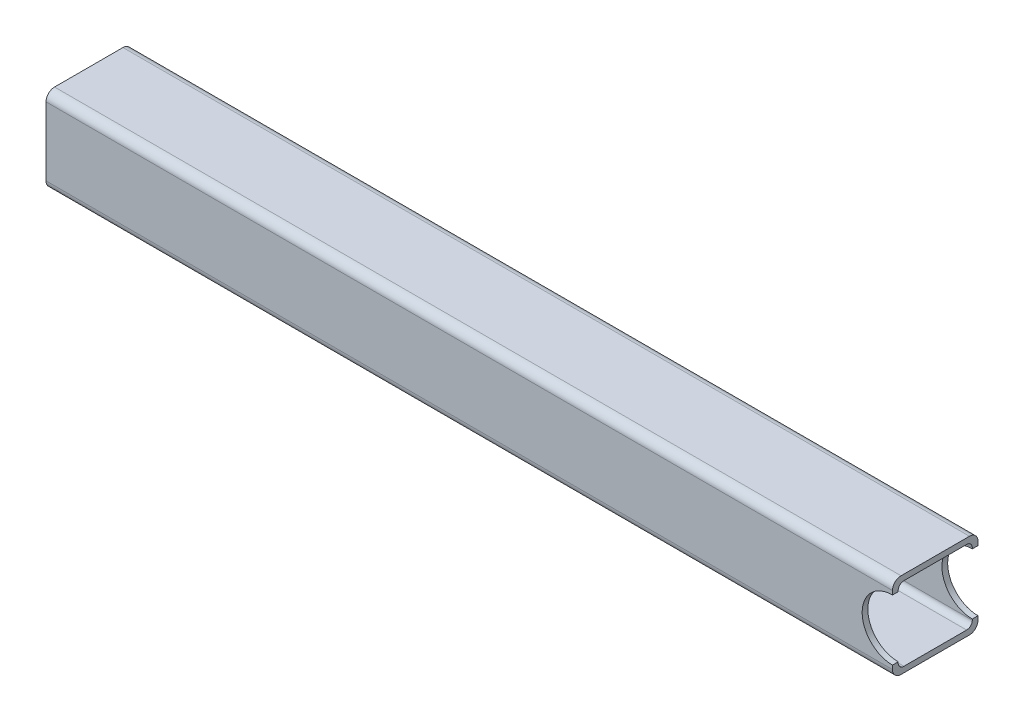
ISO-10303-21;
HEADER;
FILE_DESCRIPTION(('STEP AP214'),'2;1');
FILE_NAME('part.step','',(''),(''),'','','');
FILE_SCHEMA(('AUTOMOTIVE_DESIGN { 1 0 10303 214 1 1 1 1 }'));
ENDSEC;
DATA;
#1=APPLICATION_CONTEXT('core data for automotive mechanical design processes');
#2=APPLICATION_PROTOCOL_DEFINITION('international standard','automotive_design',2000,#1);
#3=PRODUCT_CONTEXT('',#1,'mechanical');
#4=PRODUCT('Part','Part','',(#3));
#5=PRODUCT_RELATED_PRODUCT_CATEGORY('part','',(#4));
#6=PRODUCT_DEFINITION_FORMATION('','',#4);
#7=PRODUCT_DEFINITION_CONTEXT('part definition',#1,'design');
#8=PRODUCT_DEFINITION('design','',#6,#7);
#9=PRODUCT_DEFINITION_SHAPE('','',#8);
#10=(LENGTH_UNIT() NAMED_UNIT(*) SI_UNIT(.MILLI.,.METRE.));
#11=(NAMED_UNIT(*) PLANE_ANGLE_UNIT() SI_UNIT($,.RADIAN.));
#12=(NAMED_UNIT(*) SI_UNIT($,.STERADIAN.) SOLID_ANGLE_UNIT());
#13=UNCERTAINTY_MEASURE_WITH_UNIT(LENGTH_MEASURE(1.E-05),#10,'distance_accuracy_value','');
#14=(GEOMETRIC_REPRESENTATION_CONTEXT(3) GLOBAL_UNCERTAINTY_ASSIGNED_CONTEXT((#13)) GLOBAL_UNIT_ASSIGNED_CONTEXT((#10,
#11,#12)) REPRESENTATION_CONTEXT('',''));
#15=CARTESIAN_POINT('',(0.,0.,0.));
#16=DIRECTION('',(0.,0.,1.));
#17=DIRECTION('',(1.,0.,0.));
#18=AXIS2_PLACEMENT_3D('',#15,#16,#17);
#19=CARTESIAN_POINT('',(0.,-12.,12.));
#20=DIRECTION('',(1.,0.,0.));
#21=DIRECTION('',(0.,0.,-1.));
#22=AXIS2_PLACEMENT_3D('',#19,#20,#21);
#23=PLANE('',#22);
#24=DIRECTION('',(0.,0.,1.));
#25=VECTOR('',#24,1.);
#26=CARTESIAN_POINT('',(0.,10.65,-94.622748878547));
#27=LINE('',#26,#25);
#28=CARTESIAN_POINT('',(0.,10.65,-15.));
#29=VERTEX_POINT('',#28);
#30=CARTESIAN_POINT('',(0.,10.65,-13.));
#31=VERTEX_POINT('',#30);
#32=EDGE_CURVE('E44',#29,#31,#27,.T.);
#33=ORIENTED_EDGE('',*,*,#32,.F.);
#34=DIRECTION('',(0.,1.,0.));
#35=VECTOR('',#34,1.);
#36=CARTESIAN_POINT('',(0.,12.,-15.));
#37=LINE('',#36,#35);
#38=CARTESIAN_POINT('',(0.,12.,-15.));
#39=VERTEX_POINT('',#38);
#40=EDGE_CURVE('E232',#29,#39,#37,.T.);
#41=ORIENTED_EDGE('',*,*,#40,.T.);
#42=CARTESIAN_POINT('',(0.,12.,-12.));
#43=DIRECTION('',(1.,0.,0.));
#44=DIRECTION('',(0.,0.,1.));
#45=AXIS2_PLACEMENT_3D('',#42,#43,#44);
#46=CIRCLE('',#45,3.);
#47=CARTESIAN_POINT('',(0.,15.,-12.));
#48=VERTEX_POINT('',#47);
#49=EDGE_CURVE('E276',#39,#48,#46,.T.);
#50=ORIENTED_EDGE('',*,*,#49,.T.);
#51=DIRECTION('',(0.,0.,1.));
#52=VECTOR('',#51,1.);
#53=CARTESIAN_POINT('',(0.,15.,12.));
#54=LINE('',#53,#52);
#55=CARTESIAN_POINT('',(0.,15.,12.));
#56=VERTEX_POINT('',#55);
#57=EDGE_CURVE('E244',#48,#56,#54,.T.);
#58=ORIENTED_EDGE('',*,*,#57,.T.);
#59=CARTESIAN_POINT('',(0.,12.,12.));
#60=DIRECTION('',(1.,0.,0.));
#61=DIRECTION('',(0.,0.,-1.));
#62=AXIS2_PLACEMENT_3D('',#59,#60,#61);
#63=CIRCLE('',#62,3.);
#64=CARTESIAN_POINT('',(0.,12.,15.));
#65=VERTEX_POINT('',#64);
#66=EDGE_CURVE('E236',#56,#65,#63,.T.);
#67=ORIENTED_EDGE('',*,*,#66,.T.);
#68=DIRECTION('',(0.,-1.,0.));
#69=VECTOR('',#68,1.);
#70=CARTESIAN_POINT('',(0.,12.,15.));
#71=LINE('',#70,#69);
#72=CARTESIAN_POINT('',(0.,10.65,15.));
#73=VERTEX_POINT('',#72);
#74=EDGE_CURVE('E233',#65,#73,#71,.T.);
#75=ORIENTED_EDGE('',*,*,#74,.T.);
#76=CARTESIAN_POINT('',(0.,10.65,13.));
#77=VERTEX_POINT('',#76);
#78=EDGE_CURVE('E223',#77,#73,#27,.T.);
#79=ORIENTED_EDGE('',*,*,#78,.F.);
#80=DIRECTION('',(0.,-1.,0.));
#81=VECTOR('',#80,1.);
#82=CARTESIAN_POINT('',(0.,11.,13.));
#83=LINE('',#82,#81);
#84=CARTESIAN_POINT('',(0.,11.,13.));
#85=VERTEX_POINT('',#84);
#86=EDGE_CURVE('E38',#85,#77,#83,.T.);
#87=ORIENTED_EDGE('',*,*,#86,.F.);
#88=CARTESIAN_POINT('',(0.,11.,11.));
#89=DIRECTION('',(1.,0.,0.));
#90=DIRECTION('',(0.,0.,-1.));
#91=AXIS2_PLACEMENT_3D('',#88,#89,#90);
#92=CIRCLE('',#91,2.);
#93=CARTESIAN_POINT('',(0.,13.,11.));
#94=VERTEX_POINT('',#93);
#95=EDGE_CURVE('E289',#94,#85,#92,.T.);
#96=ORIENTED_EDGE('',*,*,#95,.F.);
#97=DIRECTION('',(0.,0.,1.));
#98=VECTOR('',#97,1.);
#99=CARTESIAN_POINT('',(0.,13.,11.));
#100=LINE('',#99,#98);
#101=CARTESIAN_POINT('',(0.,13.,-11.));
#102=VERTEX_POINT('',#101);
#103=EDGE_CURVE('E207',#102,#94,#100,.T.);
#104=ORIENTED_EDGE('',*,*,#103,.F.);
#105=CARTESIAN_POINT('',(0.,11.,-11.));
#106=DIRECTION('',(1.,0.,0.));
#107=DIRECTION('',(0.,0.,1.));
#108=AXIS2_PLACEMENT_3D('',#105,#106,#107);
#109=CIRCLE('',#108,2.);
#110=CARTESIAN_POINT('',(0.,11.,-13.));
#111=VERTEX_POINT('',#110);
#112=EDGE_CURVE('E167',#111,#102,#109,.T.);
#113=ORIENTED_EDGE('',*,*,#112,.F.);
#114=DIRECTION('',(0.,1.,0.));
#115=VECTOR('',#114,1.);
#116=CARTESIAN_POINT('',(0.,11.,-13.));
#117=LINE('',#116,#115);
#118=EDGE_CURVE('E165',#31,#111,#117,.T.);
#119=ORIENTED_EDGE('',*,*,#118,.F.);
#120=EDGE_LOOP('',(#33,#41,#50,#58,#67,#75,#79,#87,#96,#104,#113,#119));
#121=FACE_BOUND('',#120,.T.);
#122=ADVANCED_FACE('F34',(#121),#23,.T.);
#123=CARTESIAN_POINT('',(-519.443177942439,-15.,12.));
#124=DIRECTION('',(0.,-1.,0.));
#125=DIRECTION('',(0.,0.,-1.));
#126=AXIS2_PLACEMENT_3D('',#123,#124,#125);
#127=PLANE('',#126);
#128=DIRECTION('',(0.,0.,1.));
#129=VECTOR('',#128,1.);
#130=CARTESIAN_POINT('',(-297.016771071246,-15.,12.));
#131=LINE('',#130,#129);
#132=CARTESIAN_POINT('',(-297.016771071246,-15.,-12.));
#133=VERTEX_POINT('',#132);
#134=CARTESIAN_POINT('',(-297.016771071246,-15.,12.));
#135=VERTEX_POINT('',#134);
#136=EDGE_CURVE('E194',#133,#135,#131,.T.);
#137=ORIENTED_EDGE('',*,*,#136,.F.);
#138=DIRECTION('',(1.,0.,0.));
#139=VECTOR('',#138,1.);
#140=CARTESIAN_POINT('',(-519.443177942439,-15.,-12.));
#141=LINE('',#140,#139);
#142=CARTESIAN_POINT('',(0.,-15.,-12.));
#143=VERTEX_POINT('',#142);
#144=EDGE_CURVE('E235',#133,#143,#141,.T.);
#145=ORIENTED_EDGE('',*,*,#144,.T.);
#146=DIRECTION('',(0.,0.,-1.));
#147=VECTOR('',#146,1.);
#148=CARTESIAN_POINT('',(0.,-15.,12.));
#149=LINE('',#148,#147);
#150=CARTESIAN_POINT('',(0.,-15.,12.));
#151=VERTEX_POINT('',#150);
#152=EDGE_CURVE('E251',#151,#143,#149,.T.);
#153=ORIENTED_EDGE('',*,*,#152,.F.);
#154=DIRECTION('',(1.,0.,0.));
#155=VECTOR('',#154,1.);
#156=CARTESIAN_POINT('',(-519.443177942439,-15.,12.));
#157=LINE('',#156,#155);
#158=EDGE_CURVE('E247',#135,#151,#157,.T.);
#159=ORIENTED_EDGE('',*,*,#158,.F.);
#160=EDGE_LOOP('',(#137,#145,#153,#159));
#161=FACE_BOUND('',#160,.T.);
#162=ADVANCED_FACE('F341',(#161),#127,.T.);
#163=CARTESIAN_POINT('',(-519.443177942439,-12.,-12.));
#164=DIRECTION('',(1.,0.,0.));
#165=DIRECTION('',(0.,0.,-1.));
#166=AXIS2_PLACEMENT_3D('',#163,#164,#165);
#167=CYLINDRICAL_SURFACE('',#166,3.);
#168=CARTESIAN_POINT('',(-297.016771071246,-12.,-12.));
#169=DIRECTION('',(1.,0.,0.));
#170=DIRECTION('',(0.,1.,0.));
#171=AXIS2_PLACEMENT_3D('',#168,#169,#170);
#172=CIRCLE('',#171,3.);
#173=CARTESIAN_POINT('',(-297.016771071246,-12.,-15.));
#174=VERTEX_POINT('',#173);
#175=EDGE_CURVE('E191',#174,#133,#172,.F.);
#176=ORIENTED_EDGE('',*,*,#175,.F.);
#177=DIRECTION('',(1.,0.,0.));
#178=VECTOR('',#177,1.);
#179=CARTESIAN_POINT('',(-519.443177942439,-12.,-15.));
#180=LINE('',#179,#178);
#181=CARTESIAN_POINT('',(0.,-12.,-15.));
#182=VERTEX_POINT('',#181);
#183=EDGE_CURVE('E242',#174,#182,#180,.T.);
#184=ORIENTED_EDGE('',*,*,#183,.T.);
#185=CARTESIAN_POINT('',(0.,-12.,-12.));
#186=DIRECTION('',(1.,0.,0.));
#187=DIRECTION('',(0.,0.,-1.));
#188=AXIS2_PLACEMENT_3D('',#185,#186,#187);
#189=CIRCLE('',#188,3.);
#190=EDGE_CURVE('E231',#143,#182,#189,.T.);
#191=ORIENTED_EDGE('',*,*,#190,.F.);
#192=ORIENTED_EDGE('',*,*,#144,.F.);
#193=EDGE_LOOP('',(#176,#184,#191,#192));
#194=FACE_BOUND('',#193,.T.);
#195=ADVANCED_FACE('F345',(#194),#167,.T.);
#196=CARTESIAN_POINT('',(-519.443177942439,12.,-15.));
#197=DIRECTION('',(0.,0.,-1.));
#198=DIRECTION('',(0.,1.,0.));
#199=AXIS2_PLACEMENT_3D('',#196,#197,#198);
#200=PLANE('',#199);
#201=CARTESIAN_POINT('',(0.,0.,-15.));
#202=DIRECTION('',(0.,0.,-1.));
#203=DIRECTION('',(0.,1.,0.));
#204=AXIS2_PLACEMENT_3D('',#201,#202,#203);
#205=CIRCLE('',#204,10.65);
#206=CARTESIAN_POINT('',(0.,-10.65,-15.));
#207=VERTEX_POINT('',#206);
#208=EDGE_CURVE('E221',#207,#29,#205,.T.);
#209=ORIENTED_EDGE('',*,*,#208,.F.);
#210=EDGE_CURVE('E228',#182,#207,#37,.T.);
#211=ORIENTED_EDGE('',*,*,#210,.F.);
#212=ORIENTED_EDGE('',*,*,#183,.F.);
#213=DIRECTION('',(0.,-1.,0.));
#214=VECTOR('',#213,1.);
#215=CARTESIAN_POINT('',(-297.016771071246,12.,-15.));
#216=LINE('',#215,#214);
#217=CARTESIAN_POINT('',(-297.016771071246,12.,-15.));
#218=VERTEX_POINT('',#217);
#219=EDGE_CURVE('E188',#218,#174,#216,.T.);
#220=ORIENTED_EDGE('',*,*,#219,.F.);
#221=DIRECTION('',(1.,0.,0.));
#222=VECTOR('',#221,1.);
#223=CARTESIAN_POINT('',(-519.443177942439,12.,-15.));
#224=LINE('',#223,#222);
#225=EDGE_CURVE('E266',#218,#39,#224,.T.);
#226=ORIENTED_EDGE('',*,*,#225,.T.);
#227=ORIENTED_EDGE('',*,*,#40,.F.);
#228=EDGE_LOOP('',(#209,#211,#212,#220,#226,#227));
#229=FACE_BOUND('',#228,.T.);
#230=ADVANCED_FACE('F350',(#229),#200,.T.);
#231=CARTESIAN_POINT('',(-519.443177942439,12.,-12.));
#232=DIRECTION('',(1.,0.,0.));
#233=DIRECTION('',(0.,0.,-1.));
#234=AXIS2_PLACEMENT_3D('',#231,#232,#233);
#235=CYLINDRICAL_SURFACE('',#234,3.);
#236=CARTESIAN_POINT('',(-297.016771071246,12.,-12.));
#237=DIRECTION('',(1.,0.,0.));
#238=DIRECTION('',(0.,1.,0.));
#239=AXIS2_PLACEMENT_3D('',#236,#237,#238);
#240=CIRCLE('',#239,3.);
#241=CARTESIAN_POINT('',(-297.016771071246,15.,-12.));
#242=VERTEX_POINT('',#241);
#243=EDGE_CURVE('E185',#242,#218,#240,.F.);
#244=ORIENTED_EDGE('',*,*,#243,.F.);
#245=DIRECTION('',(1.,0.,0.));
#246=VECTOR('',#245,1.);
#247=CARTESIAN_POINT('',(-519.443177942439,15.,-12.));
#248=LINE('',#247,#246);
#249=EDGE_CURVE('E269',#242,#48,#248,.T.);
#250=ORIENTED_EDGE('',*,*,#249,.T.);
#251=ORIENTED_EDGE('',*,*,#49,.F.);
#252=ORIENTED_EDGE('',*,*,#225,.F.);
#253=EDGE_LOOP('',(#244,#250,#251,#252));
#254=FACE_BOUND('',#253,.T.);
#255=ADVANCED_FACE('F395',(#254),#235,.T.);
#256=CARTESIAN_POINT('',(-519.443177942439,15.,12.));
#257=DIRECTION('',(0.,1.,0.));
#258=DIRECTION('',(0.,0.,1.));
#259=AXIS2_PLACEMENT_3D('',#256,#257,#258);
#260=PLANE('',#259);
#261=DIRECTION('',(0.,0.,-1.));
#262=VECTOR('',#261,1.);
#263=CARTESIAN_POINT('',(-297.016771071246,15.,12.));
#264=LINE('',#263,#262);
#265=CARTESIAN_POINT('',(-297.016771071246,15.,12.));
#266=VERTEX_POINT('',#265);
#267=EDGE_CURVE('E182',#266,#242,#264,.T.);
#268=ORIENTED_EDGE('',*,*,#267,.F.);
#269=DIRECTION('',(1.,0.,0.));
#270=VECTOR('',#269,1.);
#271=CARTESIAN_POINT('',(-519.443177942439,15.,12.));
#272=LINE('',#271,#270);
#273=EDGE_CURVE('E271',#266,#56,#272,.T.);
#274=ORIENTED_EDGE('',*,*,#273,.T.);
#275=ORIENTED_EDGE('',*,*,#57,.F.);
#276=ORIENTED_EDGE('',*,*,#249,.F.);
#277=EDGE_LOOP('',(#268,#274,#275,#276));
#278=FACE_BOUND('',#277,.T.);
#279=ADVANCED_FACE('F398',(#278),#260,.T.);
#280=CARTESIAN_POINT('',(-519.443177942439,12.,12.));
#281=DIRECTION('',(1.,0.,0.));
#282=DIRECTION('',(0.,0.,-1.));
#283=AXIS2_PLACEMENT_3D('',#280,#281,#282);
#284=CYLINDRICAL_SURFACE('',#283,3.);
#285=CARTESIAN_POINT('',(-297.016771071246,12.,12.));
#286=DIRECTION('',(1.,0.,0.));
#287=DIRECTION('',(0.,1.,0.));
#288=AXIS2_PLACEMENT_3D('',#285,#286,#287);
#289=CIRCLE('',#288,3.);
#290=CARTESIAN_POINT('',(-297.016771071246,12.,15.));
#291=VERTEX_POINT('',#290);
#292=EDGE_CURVE('E179',#291,#266,#289,.F.);
#293=ORIENTED_EDGE('',*,*,#292,.F.);
#294=DIRECTION('',(1.,0.,0.));
#295=VECTOR('',#294,1.);
#296=CARTESIAN_POINT('',(-519.443177942439,12.,15.));
#297=LINE('',#296,#295);
#298=EDGE_CURVE('E260',#291,#65,#297,.T.);
#299=ORIENTED_EDGE('',*,*,#298,.T.);
#300=ORIENTED_EDGE('',*,*,#66,.F.);
#301=ORIENTED_EDGE('',*,*,#273,.F.);
#302=EDGE_LOOP('',(#293,#299,#300,#301));
#303=FACE_BOUND('',#302,.T.);
#304=ADVANCED_FACE('F391',(#303),#284,.T.);
#305=CARTESIAN_POINT('',(-519.443177942439,12.,15.));
#306=DIRECTION('',(0.,0.,1.));
#307=DIRECTION('',(1.,0.,0.));
#308=AXIS2_PLACEMENT_3D('',#305,#306,#307);
#309=PLANE('',#308);
#310=CARTESIAN_POINT('',(0.,0.,15.));
#311=DIRECTION('',(0.,0.,1.));
#312=DIRECTION('',(1.,0.,0.));
#313=AXIS2_PLACEMENT_3D('',#310,#311,#312);
#314=CIRCLE('',#313,10.65);
#315=CARTESIAN_POINT('',(0.,-10.65,15.));
#316=VERTEX_POINT('',#315);
#317=EDGE_CURVE('E69',#73,#316,#314,.T.);
#318=ORIENTED_EDGE('',*,*,#317,.F.);
#319=ORIENTED_EDGE('',*,*,#74,.F.);
#320=ORIENTED_EDGE('',*,*,#298,.F.);
#321=DIRECTION('',(0.,1.,0.));
#322=VECTOR('',#321,1.);
#323=CARTESIAN_POINT('',(-297.016771071246,11.9999999999999,15.));
#324=LINE('',#323,#322);
#325=CARTESIAN_POINT('',(-297.016771071246,-12.,15.));
#326=VERTEX_POINT('',#325);
#327=EDGE_CURVE('E176',#326,#291,#324,.T.);
#328=ORIENTED_EDGE('',*,*,#327,.F.);
#329=DIRECTION('',(1.,0.,0.));
#330=VECTOR('',#329,1.);
#331=CARTESIAN_POINT('',(-519.443177942439,-12.,15.));
#332=LINE('',#331,#330);
#333=CARTESIAN_POINT('',(0.,-12.,15.));
#334=VERTEX_POINT('',#333);
#335=EDGE_CURVE('E253',#326,#334,#332,.T.);
#336=ORIENTED_EDGE('',*,*,#335,.T.);
#337=EDGE_CURVE('E237',#316,#334,#71,.T.);
#338=ORIENTED_EDGE('',*,*,#337,.F.);
#339=EDGE_LOOP('',(#318,#319,#320,#328,#336,#338));
#340=FACE_BOUND('',#339,.T.);
#341=ADVANCED_FACE('F36',(#340),#309,.T.);
#342=CARTESIAN_POINT('',(-519.443177942439,-12.,12.));
#343=DIRECTION('',(1.,0.,0.));
#344=DIRECTION('',(0.,0.,-1.));
#345=AXIS2_PLACEMENT_3D('',#342,#343,#344);
#346=CYLINDRICAL_SURFACE('',#345,3.);
#347=CARTESIAN_POINT('',(-297.016771071246,-12.,12.));
#348=DIRECTION('',(1.,0.,0.));
#349=DIRECTION('',(0.,1.,0.));
#350=AXIS2_PLACEMENT_3D('',#347,#348,#349);
#351=CIRCLE('',#350,3.);
#352=EDGE_CURVE('E172',#135,#326,#351,.F.);
#353=ORIENTED_EDGE('',*,*,#352,.F.);
#354=ORIENTED_EDGE('',*,*,#158,.T.);
#355=CARTESIAN_POINT('',(0.,-12.,12.));
#356=DIRECTION('',(1.,0.,0.));
#357=DIRECTION('',(0.,0.,-1.));
#358=AXIS2_PLACEMENT_3D('',#355,#356,#357);
#359=CIRCLE('',#358,3.);
#360=EDGE_CURVE('E246',#334,#151,#359,.T.);
#361=ORIENTED_EDGE('',*,*,#360,.F.);
#362=ORIENTED_EDGE('',*,*,#335,.F.);
#363=EDGE_LOOP('',(#353,#354,#361,#362));
#364=FACE_BOUND('',#363,.T.);
#365=ADVANCED_FACE('F338',(#364),#346,.T.);
#366=DIRECTION('',(0.,0.,1.));
#367=VECTOR('',#366,1.);
#368=CARTESIAN_POINT('',(0.,-10.65,-94.622748878547));
#369=LINE('',#368,#367);
#370=CARTESIAN_POINT('',(0.,-10.65,13.));
#371=VERTEX_POINT('',#370);
#372=EDGE_CURVE('E46',#316,#371,#369,.F.);
#373=ORIENTED_EDGE('',*,*,#372,.F.);
#374=ORIENTED_EDGE('',*,*,#337,.T.);
#375=ORIENTED_EDGE('',*,*,#360,.T.);
#376=ORIENTED_EDGE('',*,*,#152,.T.);
#377=ORIENTED_EDGE('',*,*,#190,.T.);
#378=ORIENTED_EDGE('',*,*,#210,.T.);
#379=CARTESIAN_POINT('',(0.,-10.65,-13.));
#380=VERTEX_POINT('',#379);
#381=EDGE_CURVE('E11',#380,#207,#369,.F.);
#382=ORIENTED_EDGE('',*,*,#381,.F.);
#383=CARTESIAN_POINT('',(0.,-11.,-13.));
#384=VERTEX_POINT('',#383);
#385=EDGE_CURVE('E161',#384,#380,#117,.T.);
#386=ORIENTED_EDGE('',*,*,#385,.F.);
#387=CARTESIAN_POINT('',(0.,-11.,-11.));
#388=DIRECTION('',(1.,0.,0.));
#389=DIRECTION('',(0.,0.,-1.));
#390=AXIS2_PLACEMENT_3D('',#387,#388,#389);
#391=CIRCLE('',#390,2.);
#392=CARTESIAN_POINT('',(0.,-13.,-11.));
#393=VERTEX_POINT('',#392);
#394=EDGE_CURVE('E143',#393,#384,#391,.T.);
#395=ORIENTED_EDGE('',*,*,#394,.F.);
#396=DIRECTION('',(0.,0.,-1.));
#397=VECTOR('',#396,1.);
#398=CARTESIAN_POINT('',(0.,-13.,11.));
#399=LINE('',#398,#397);
#400=CARTESIAN_POINT('',(0.,-13.,11.));
#401=VERTEX_POINT('',#400);
#402=EDGE_CURVE('E152',#401,#393,#399,.T.);
#403=ORIENTED_EDGE('',*,*,#402,.F.);
#404=CARTESIAN_POINT('',(0.,-11.,11.));
#405=DIRECTION('',(1.,0.,0.));
#406=DIRECTION('',(0.,0.,-1.));
#407=AXIS2_PLACEMENT_3D('',#404,#405,#406);
#408=CIRCLE('',#407,2.);
#409=CARTESIAN_POINT('',(0.,-11.,13.));
#410=VERTEX_POINT('',#409);
#411=EDGE_CURVE('E170',#410,#401,#408,.T.);
#412=ORIENTED_EDGE('',*,*,#411,.F.);
#413=EDGE_CURVE('E202',#371,#410,#83,.T.);
#414=ORIENTED_EDGE('',*,*,#413,.F.);
#415=EDGE_LOOP('',(#373,#374,#375,#376,#377,#378,#382,#386,#395,#403,#412,#414));
#416=FACE_BOUND('',#415,.T.);
#417=ADVANCED_FACE('F159',(#416),#23,.T.);
#418=CARTESIAN_POINT('',(-519.443177942439,-13.,11.));
#419=DIRECTION('',(0.,-1.,0.));
#420=DIRECTION('',(0.,0.,-1.));
#421=AXIS2_PLACEMENT_3D('',#418,#419,#420);
#422=PLANE('',#421);
#423=DIRECTION('',(1.,0.,0.));
#424=VECTOR('',#423,1.);
#425=CARTESIAN_POINT('',(-519.443177942439,-13.,-11.));
#426=LINE('',#425,#424);
#427=CARTESIAN_POINT('',(-297.016771071246,-13.,-11.));
#428=VERTEX_POINT('',#427);
#429=EDGE_CURVE('E138',#428,#393,#426,.T.);
#430=ORIENTED_EDGE('',*,*,#429,.F.);
#431=DIRECTION('',(0.,0.,1.));
#432=VECTOR('',#431,1.);
#433=CARTESIAN_POINT('',(-297.016771071246,-13.,11.));
#434=LINE('',#433,#432);
#435=CARTESIAN_POINT('',(-297.016771071246,-13.,11.));
#436=VERTEX_POINT('',#435);
#437=EDGE_CURVE('E230',#428,#436,#434,.T.);
#438=ORIENTED_EDGE('',*,*,#437,.T.);
#439=DIRECTION('',(1.,0.,0.));
#440=VECTOR('',#439,1.);
#441=CARTESIAN_POINT('',(-519.443177942439,-13.,11.));
#442=LINE('',#441,#440);
#443=EDGE_CURVE('E154',#436,#401,#442,.T.);
#444=ORIENTED_EDGE('',*,*,#443,.T.);
#445=ORIENTED_EDGE('',*,*,#402,.T.);
#446=EDGE_LOOP('',(#430,#438,#444,#445));
#447=FACE_BOUND('',#446,.T.);
#448=ADVANCED_FACE('F153',(#447),#422,.F.);
#449=CARTESIAN_POINT('',(-519.443177942439,-11.,-11.));
#450=DIRECTION('',(1.,0.,0.));
#451=DIRECTION('',(0.,0.,-1.));
#452=AXIS2_PLACEMENT_3D('',#449,#450,#451);
#453=CYLINDRICAL_SURFACE('',#452,2.);
#454=DIRECTION('',(1.,0.,0.));
#455=VECTOR('',#454,1.);
#456=CARTESIAN_POINT('',(-519.443177942439,-11.,-13.));
#457=LINE('',#456,#455);
#458=CARTESIAN_POINT('',(-297.016771071246,-11.,-13.));
#459=VERTEX_POINT('',#458);
#460=EDGE_CURVE('E216',#459,#384,#457,.T.);
#461=ORIENTED_EDGE('',*,*,#460,.F.);
#462=CARTESIAN_POINT('',(-297.016771071246,-11.,-11.));
#463=DIRECTION('',(1.,0.,0.));
#464=DIRECTION('',(0.,1.,0.));
#465=AXIS2_PLACEMENT_3D('',#462,#463,#464);
#466=CIRCLE('',#465,2.);
#467=EDGE_CURVE('E147',#459,#428,#466,.F.);
#468=ORIENTED_EDGE('',*,*,#467,.T.);
#469=ORIENTED_EDGE('',*,*,#429,.T.);
#470=ORIENTED_EDGE('',*,*,#394,.T.);
#471=EDGE_LOOP('',(#461,#468,#469,#470));
#472=FACE_BOUND('',#471,.T.);
#473=ADVANCED_FACE('F141',(#472),#453,.F.);
#474=CARTESIAN_POINT('',(-519.443177942439,11.,-13.));
#475=DIRECTION('',(0.,0.,-1.));
#476=DIRECTION('',(-1.,0.,0.));
#477=AXIS2_PLACEMENT_3D('',#474,#475,#476);
#478=PLANE('',#477);
#479=ORIENTED_EDGE('',*,*,#385,.T.);
#480=CARTESIAN_POINT('',(0.,0.,-13.));
#481=DIRECTION('',(0.,0.,-1.));
#482=DIRECTION('',(-1.,0.,0.));
#483=AXIS2_PLACEMENT_3D('',#480,#481,#482);
#484=CIRCLE('',#483,10.65);
#485=EDGE_CURVE('E163',#380,#31,#484,.T.);
#486=ORIENTED_EDGE('',*,*,#485,.T.);
#487=ORIENTED_EDGE('',*,*,#118,.T.);
#488=DIRECTION('',(1.,0.,0.));
#489=VECTOR('',#488,1.);
#490=CARTESIAN_POINT('',(-519.443177942439,11.,-13.));
#491=LINE('',#490,#489);
#492=CARTESIAN_POINT('',(-297.016771071246,11.,-13.));
#493=VERTEX_POINT('',#492);
#494=EDGE_CURVE('E215',#493,#111,#491,.T.);
#495=ORIENTED_EDGE('',*,*,#494,.F.);
#496=DIRECTION('',(0.,-1.,0.));
#497=VECTOR('',#496,1.);
#498=CARTESIAN_POINT('',(-297.016771071246,11.,-13.));
#499=LINE('',#498,#497);
#500=EDGE_CURVE('E217',#493,#459,#499,.T.);
#501=ORIENTED_EDGE('',*,*,#500,.T.);
#502=ORIENTED_EDGE('',*,*,#460,.T.);
#503=EDGE_LOOP('',(#479,#486,#487,#495,#501,#502));
#504=FACE_BOUND('',#503,.T.);
#505=ADVANCED_FACE('F353',(#504),#478,.F.);
#506=CARTESIAN_POINT('',(-519.443177942439,11.,-11.));
#507=DIRECTION('',(1.,0.,0.));
#508=DIRECTION('',(0.,0.,-1.));
#509=AXIS2_PLACEMENT_3D('',#506,#507,#508);
#510=CYLINDRICAL_SURFACE('',#509,2.);
#511=DIRECTION('',(1.,0.,0.));
#512=VECTOR('',#511,1.);
#513=CARTESIAN_POINT('',(-519.443177942439,13.,-11.));
#514=LINE('',#513,#512);
#515=CARTESIAN_POINT('',(-297.016771071246,13.,-11.));
#516=VERTEX_POINT('',#515);
#517=EDGE_CURVE('E211',#516,#102,#514,.T.);
#518=ORIENTED_EDGE('',*,*,#517,.F.);
#519=CARTESIAN_POINT('',(-297.016771071246,11.,-11.));
#520=DIRECTION('',(1.,0.,0.));
#521=DIRECTION('',(0.,1.,0.));
#522=AXIS2_PLACEMENT_3D('',#519,#520,#521);
#523=CIRCLE('',#522,2.);
#524=EDGE_CURVE('E212',#516,#493,#523,.F.);
#525=ORIENTED_EDGE('',*,*,#524,.T.);
#526=ORIENTED_EDGE('',*,*,#494,.T.);
#527=ORIENTED_EDGE('',*,*,#112,.T.);
#528=EDGE_LOOP('',(#518,#525,#526,#527));
#529=FACE_BOUND('',#528,.T.);
#530=ADVANCED_FACE('F363',(#529),#510,.F.);
#531=CARTESIAN_POINT('',(-519.443177942439,13.,11.));
#532=DIRECTION('',(0.,1.,0.));
#533=DIRECTION('',(0.,0.,1.));
#534=AXIS2_PLACEMENT_3D('',#531,#532,#533);
#535=PLANE('',#534);
#536=DIRECTION('',(1.,0.,0.));
#537=VECTOR('',#536,1.);
#538=CARTESIAN_POINT('',(-519.443177942439,13.,11.));
#539=LINE('',#538,#537);
#540=CARTESIAN_POINT('',(-297.016771071246,13.,11.));
#541=VERTEX_POINT('',#540);
#542=EDGE_CURVE('E206',#541,#94,#539,.T.);
#543=ORIENTED_EDGE('',*,*,#542,.F.);
#544=DIRECTION('',(0.,0.,-1.));
#545=VECTOR('',#544,1.);
#546=CARTESIAN_POINT('',(-297.016771071246,13.,11.));
#547=LINE('',#546,#545);
#548=EDGE_CURVE('E208',#541,#516,#547,.T.);
#549=ORIENTED_EDGE('',*,*,#548,.T.);
#550=ORIENTED_EDGE('',*,*,#517,.T.);
#551=ORIENTED_EDGE('',*,*,#103,.T.);
#552=EDGE_LOOP('',(#543,#549,#550,#551));
#553=FACE_BOUND('',#552,.T.);
#554=ADVANCED_FACE('F299',(#553),#535,.F.);
#555=CARTESIAN_POINT('',(-519.443177942439,11.,11.));
#556=DIRECTION('',(1.,0.,0.));
#557=DIRECTION('',(0.,0.,-1.));
#558=AXIS2_PLACEMENT_3D('',#555,#556,#557);
#559=CYLINDRICAL_SURFACE('',#558,2.);
#560=DIRECTION('',(1.,0.,0.));
#561=VECTOR('',#560,1.);
#562=CARTESIAN_POINT('',(-519.443177942439,11.,13.));
#563=LINE('',#562,#561);
#564=CARTESIAN_POINT('',(-297.016771071246,11.,13.));
#565=VERTEX_POINT('',#564);
#566=EDGE_CURVE('E198',#565,#85,#563,.T.);
#567=ORIENTED_EDGE('',*,*,#566,.F.);
#568=CARTESIAN_POINT('',(-297.016771071246,11.,11.));
#569=DIRECTION('',(1.,0.,0.));
#570=DIRECTION('',(0.,1.,0.));
#571=AXIS2_PLACEMENT_3D('',#568,#569,#570);
#572=CIRCLE('',#571,2.);
#573=EDGE_CURVE('E203',#565,#541,#572,.F.);
#574=ORIENTED_EDGE('',*,*,#573,.T.);
#575=ORIENTED_EDGE('',*,*,#542,.T.);
#576=ORIENTED_EDGE('',*,*,#95,.T.);
#577=EDGE_LOOP('',(#567,#574,#575,#576));
#578=FACE_BOUND('',#577,.T.);
#579=ADVANCED_FACE('F309',(#578),#559,.F.);
#580=CARTESIAN_POINT('',(-519.443177942439,11.,13.));
#581=DIRECTION('',(0.,0.,1.));
#582=DIRECTION('',(1.,0.,0.));
#583=AXIS2_PLACEMENT_3D('',#580,#581,#582);
#584=PLANE('',#583);
#585=ORIENTED_EDGE('',*,*,#86,.T.);
#586=CARTESIAN_POINT('',(0.,0.,13.));
#587=DIRECTION('',(0.,0.,1.));
#588=DIRECTION('',(1.,0.,0.));
#589=AXIS2_PLACEMENT_3D('',#586,#587,#588);
#590=CIRCLE('',#589,10.65);
#591=EDGE_CURVE('E550',#77,#371,#590,.T.);
#592=ORIENTED_EDGE('',*,*,#591,.T.);
#593=ORIENTED_EDGE('',*,*,#413,.T.);
#594=DIRECTION('',(1.,0.,0.));
#595=VECTOR('',#594,1.);
#596=CARTESIAN_POINT('',(-519.443177942439,-11.,13.));
#597=LINE('',#596,#595);
#598=CARTESIAN_POINT('',(-297.016771071246,-11.,13.));
#599=VERTEX_POINT('',#598);
#600=EDGE_CURVE('E173',#599,#410,#597,.T.);
#601=ORIENTED_EDGE('',*,*,#600,.F.);
#602=DIRECTION('',(0.,1.,0.));
#603=VECTOR('',#602,1.);
#604=CARTESIAN_POINT('',(-297.016771071246,11.,13.));
#605=LINE('',#604,#603);
#606=EDGE_CURVE('E199',#599,#565,#605,.T.);
#607=ORIENTED_EDGE('',*,*,#606,.T.);
#608=ORIENTED_EDGE('',*,*,#566,.T.);
#609=EDGE_LOOP('',(#585,#592,#593,#601,#607,#608));
#610=FACE_BOUND('',#609,.T.);
#611=ADVANCED_FACE('F408',(#610),#584,.F.);
#612=CARTESIAN_POINT('',(-519.443177942439,-11.,11.));
#613=DIRECTION('',(1.,0.,0.));
#614=DIRECTION('',(0.,0.,-1.));
#615=AXIS2_PLACEMENT_3D('',#612,#613,#614);
#616=CYLINDRICAL_SURFACE('',#615,2.);
#617=ORIENTED_EDGE('',*,*,#443,.F.);
#618=CARTESIAN_POINT('',(-297.016771071246,-11.,11.));
#619=DIRECTION('',(1.,0.,0.));
#620=DIRECTION('',(0.,1.,0.));
#621=AXIS2_PLACEMENT_3D('',#618,#619,#620);
#622=CIRCLE('',#621,2.);
#623=EDGE_CURVE('E79',#436,#599,#622,.F.);
#624=ORIENTED_EDGE('',*,*,#623,.T.);
#625=ORIENTED_EDGE('',*,*,#600,.T.);
#626=ORIENTED_EDGE('',*,*,#411,.T.);
#627=EDGE_LOOP('',(#617,#624,#625,#626));
#628=FACE_BOUND('',#627,.T.);
#629=ADVANCED_FACE('F406',(#628),#616,.F.);
#630=CARTESIAN_POINT('',(-297.016771071246,-47.,12.));
#631=DIRECTION('',(1.,0.,0.));
#632=DIRECTION('',(0.,0.,-1.));
#633=AXIS2_PLACEMENT_3D('',#630,#631,#632);
#634=PLANE('',#633);
#635=ORIENTED_EDGE('',*,*,#352,.T.);
#636=ORIENTED_EDGE('',*,*,#327,.T.);
#637=ORIENTED_EDGE('',*,*,#292,.T.);
#638=ORIENTED_EDGE('',*,*,#267,.T.);
#639=ORIENTED_EDGE('',*,*,#243,.T.);
#640=ORIENTED_EDGE('',*,*,#219,.T.);
#641=ORIENTED_EDGE('',*,*,#175,.T.);
#642=ORIENTED_EDGE('',*,*,#136,.T.);
#643=EDGE_LOOP('',(#635,#636,#637,#638,#639,#640,#641,#642));
#644=FACE_BOUND('',#643,.T.);
#645=ORIENTED_EDGE('',*,*,#437,.F.);
#646=ORIENTED_EDGE('',*,*,#467,.F.);
#647=ORIENTED_EDGE('',*,*,#500,.F.);
#648=ORIENTED_EDGE('',*,*,#524,.F.);
#649=ORIENTED_EDGE('',*,*,#548,.F.);
#650=ORIENTED_EDGE('',*,*,#573,.F.);
#651=ORIENTED_EDGE('',*,*,#606,.F.);
#652=ORIENTED_EDGE('',*,*,#623,.F.);
#653=EDGE_LOOP('',(#645,#646,#647,#648,#649,#650,#651,#652));
#654=FACE_BOUND('',#653,.T.);
#655=ADVANCED_FACE('F314',(#644,#654),#634,.F.);
#656=CARTESIAN_POINT('',(0.,0.,-94.622748878547));
#657=DIRECTION('',(0.,0.,1.));
#658=DIRECTION('',(0.652201371492647,0.75804575786895,0.));
#659=AXIS2_PLACEMENT_3D('',#656,#657,#658);
#660=CYLINDRICAL_SURFACE('',#659,10.65);
#661=ORIENTED_EDGE('',*,*,#317,.T.);
#662=ORIENTED_EDGE('',*,*,#372,.T.);
#663=ORIENTED_EDGE('',*,*,#591,.F.);
#664=ORIENTED_EDGE('',*,*,#78,.T.);
#665=EDGE_LOOP('',(#661,#662,#663,#664));
#666=FACE_BOUND('',#665,.T.);
#667=ADVANCED_FACE('F368',(#666),#660,.F.);
#668=ORIENTED_EDGE('',*,*,#208,.T.);
#669=ORIENTED_EDGE('',*,*,#32,.T.);
#670=ORIENTED_EDGE('',*,*,#485,.F.);
#671=ORIENTED_EDGE('',*,*,#381,.T.);
#672=EDGE_LOOP('',(#668,#669,#670,#671));
#673=FACE_BOUND('',#672,.T.);
#674=ADVANCED_FACE('F366',(#673),#660,.F.);
#675=CLOSED_SHELL('',(#122,#162,#195,#230,#255,#279,#304,#341,#365,#417,#448,#473,#505,#530,
#554,#579,#611,#629,#655,#667,#674));
#676=MANIFOLD_SOLID_BREP('B2',#675);
#677=ADVANCED_BREP_SHAPE_REPRESENTATION('',(#18,#676),#14);
#678=SHAPE_DEFINITION_REPRESENTATION(#9,#677);
ENDSEC;
END-ISO-10303-21;
